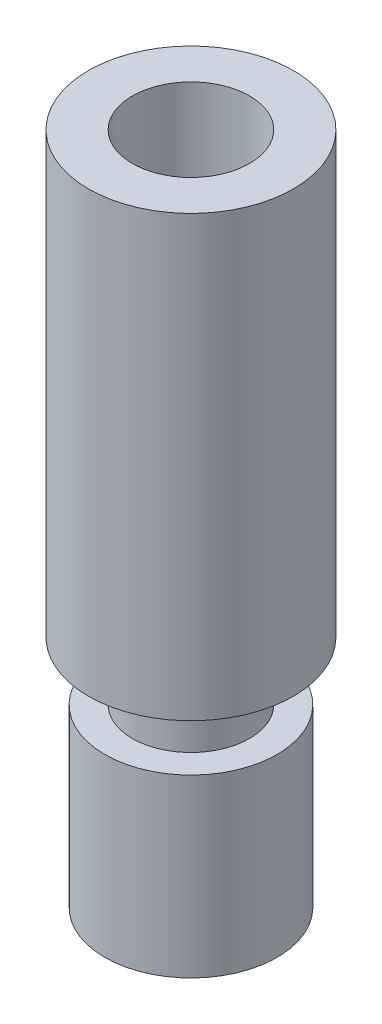
ISO-10303-21;
HEADER;
FILE_DESCRIPTION(('STEP AP214'),'2;1');
FILE_NAME('part.step','',(''),(''),'','','');
FILE_SCHEMA(('AUTOMOTIVE_DESIGN { 1 0 10303 214 1 1 1 1 }'));
ENDSEC;
DATA;
#1=APPLICATION_CONTEXT('core data for automotive mechanical design processes');
#2=APPLICATION_PROTOCOL_DEFINITION('international standard','automotive_design',2000,#1);
#3=PRODUCT_CONTEXT('',#1,'mechanical');
#4=PRODUCT('Part','Part','',(#3));
#5=PRODUCT_RELATED_PRODUCT_CATEGORY('part','',(#4));
#6=PRODUCT_DEFINITION_FORMATION('','',#4);
#7=PRODUCT_DEFINITION_CONTEXT('part definition',#1,'design');
#8=PRODUCT_DEFINITION('design','',#6,#7);
#9=PRODUCT_DEFINITION_SHAPE('','',#8);
#10=(LENGTH_UNIT() NAMED_UNIT(*) SI_UNIT(.MILLI.,.METRE.));
#11=(NAMED_UNIT(*) PLANE_ANGLE_UNIT() SI_UNIT($,.RADIAN.));
#12=(NAMED_UNIT(*) SI_UNIT($,.STERADIAN.) SOLID_ANGLE_UNIT());
#13=UNCERTAINTY_MEASURE_WITH_UNIT(LENGTH_MEASURE(1.E-05),#10,'distance_accuracy_value','');
#14=(GEOMETRIC_REPRESENTATION_CONTEXT(3) GLOBAL_UNCERTAINTY_ASSIGNED_CONTEXT((#13)) GLOBAL_UNIT_ASSIGNED_CONTEXT((#10,
#11,#12)) REPRESENTATION_CONTEXT('',''));
#15=CARTESIAN_POINT('',(0.,0.,0.));
#16=DIRECTION('',(0.,0.,1.));
#17=DIRECTION('',(1.,0.,0.));
#18=AXIS2_PLACEMENT_3D('',#15,#16,#17);
#19=CARTESIAN_POINT('',(15.500000230968,14.,7.00000010430813));
#20=DIRECTION('',(0.,1.,0.));
#21=DIRECTION('',(0.,0.,1.));
#22=AXIS2_PLACEMENT_3D('',#19,#20,#21);
#23=PLANE('',#22);
#24=CARTESIAN_POINT('',(15.500000230968,14.,7.00000010430813));
#25=DIRECTION('',(0.,-1.,0.));
#26=DIRECTION('',(0.,0.,-1.));
#27=AXIS2_PLACEMENT_3D('',#24,#25,#26);
#28=CIRCLE('',#27,1.5);
#29=CARTESIAN_POINT('',(15.500000230968,14.,5.50000010430813));
#30=VERTEX_POINT('',#29);
#31=EDGE_CURVE('E17',#30,#30,#28,.F.);
#32=ORIENTED_EDGE('',*,*,#31,.T.);
#33=EDGE_LOOP('',(#32));
#34=FACE_BOUND('',#33,.T.);
#35=CARTESIAN_POINT('',(15.500000230968,14.,7.00000010430813));
#36=DIRECTION('',(0.,-1.,0.));
#37=DIRECTION('',(0.,0.,-1.));
#38=AXIS2_PLACEMENT_3D('',#35,#36,#37);
#39=CIRCLE('',#38,2.942);
#40=CARTESIAN_POINT('',(15.500000230968,14.,4.05800010430813));
#41=VERTEX_POINT('',#40);
#42=EDGE_CURVE('E44',#41,#41,#39,.F.);
#43=ORIENTED_EDGE('',*,*,#42,.F.);
#44=EDGE_LOOP('',(#43));
#45=FACE_BOUND('',#44,.T.);
#46=ADVANCED_FACE('F14',(#34,#45),#23,.F.);
#47=CARTESIAN_POINT('',(15.500000230968,22.75,7.00000010430813));
#48=DIRECTION('',(0.,-1.,0.));
#49=DIRECTION('',(0.,0.,-1.));
#50=AXIS2_PLACEMENT_3D('',#47,#48,#49);
#51=CYLINDRICAL_SURFACE('',#50,1.5);
#52=ORIENTED_EDGE('',*,*,#31,.F.);
#53=EDGE_LOOP('',(#52));
#54=FACE_BOUND('',#53,.T.);
#55=CARTESIAN_POINT('',(15.500000230968,31.4999999999941,7.00000010430813));
#56=DIRECTION('',(0.,1.,0.));
#57=DIRECTION('',(0.999999999999998,0.,-6.56625413746781E-08));
#58=AXIS2_PLACEMENT_3D('',#55,#56,#57);
#59=CIRCLE('',#58,1.50000000003957);
#60=CARTESIAN_POINT('',(17.0000002310076,31.4999999999941,7.00000000581432));
#61=VERTEX_POINT('',#60);
#62=EDGE_CURVE('E43',#61,#61,#59,.T.);
#63=ORIENTED_EDGE('',*,*,#62,.T.);
#64=EDGE_LOOP('',(#63));
#65=FACE_BOUND('',#64,.T.);
#66=ADVANCED_FACE('F54',(#54,#65),#51,.F.);
#67=CARTESIAN_POINT('',(15.500000230968,20.,7.00000010430813));
#68=DIRECTION('',(0.,-1.,0.));
#69=DIRECTION('',(0.,0.,-1.));
#70=AXIS2_PLACEMENT_3D('',#67,#68,#69);
#71=CYLINDRICAL_SURFACE('',#70,2.942);
#72=CARTESIAN_POINT('',(15.500000230968,20.,7.00000010430813));
#73=DIRECTION('',(0.,-1.,0.));
#74=DIRECTION('',(0.,0.,-1.));
#75=AXIS2_PLACEMENT_3D('',#72,#73,#74);
#76=CIRCLE('',#75,2.942);
#77=CARTESIAN_POINT('',(15.500000230968,20.,4.05800010430813));
#78=VERTEX_POINT('',#77);
#79=EDGE_CURVE('E41',#78,#78,#76,.F.);
#80=ORIENTED_EDGE('',*,*,#79,.F.);
#81=EDGE_LOOP('',(#80));
#82=FACE_BOUND('',#81,.T.);
#83=ORIENTED_EDGE('',*,*,#42,.T.);
#84=EDGE_LOOP('',(#83));
#85=FACE_BOUND('',#84,.T.);
#86=ADVANCED_FACE('F57',(#82,#85),#71,.T.);
#87=CARTESIAN_POINT('',(15.500000230968,31.9999999999254,7.00000010430813));
#88=DIRECTION('',(0.,1.,0.));
#89=DIRECTION('',(0.,0.,1.));
#90=AXIS2_PLACEMENT_3D('',#87,#88,#89);
#91=CONICAL_SURFACE('',#90,1.9999999999709,0.785398163454293);
#92=ORIENTED_EDGE('',*,*,#62,.F.);
#93=EDGE_LOOP('',(#92));
#94=FACE_BOUND('',#93,.T.);
#95=CARTESIAN_POINT('',(15.500000230968,32.,7.00000010430813));
#96=DIRECTION('',(0.,-1.,0.));
#97=DIRECTION('',(0.,0.,-1.));
#98=AXIS2_PLACEMENT_3D('',#95,#96,#97);
#99=CIRCLE('',#98,2.);
#100=CARTESIAN_POINT('',(15.500000230968,32.,5.00000010430813));
#101=VERTEX_POINT('',#100);
#102=EDGE_CURVE('E40',#101,#101,#99,.F.);
#103=ORIENTED_EDGE('',*,*,#102,.T.);
#104=EDGE_LOOP('',(#103));
#105=FACE_BOUND('',#104,.T.);
#106=ADVANCED_FACE('F60',(#94,#105),#91,.F.);
#107=CARTESIAN_POINT('',(15.500000230968,20.,7.00000010430813));
#108=DIRECTION('',(0.,1.,0.));
#109=DIRECTION('',(0.,0.,1.));
#110=AXIS2_PLACEMENT_3D('',#107,#108,#109);
#111=PLANE('',#110);
#112=CARTESIAN_POINT('',(15.500000230968,20.,7.00000010430813));
#113=DIRECTION('',(0.,1.,0.));
#114=DIRECTION('',(0.,0.,1.));
#115=AXIS2_PLACEMENT_3D('',#112,#113,#114);
#116=CIRCLE('',#115,2.);
#117=CARTESIAN_POINT('',(15.500000230968,20.,9.00000010430813));
#118=VERTEX_POINT('',#117);
#119=EDGE_CURVE('E37',#118,#118,#116,.T.);
#120=ORIENTED_EDGE('',*,*,#119,.F.);
#121=EDGE_LOOP('',(#120));
#122=FACE_BOUND('',#121,.T.);
#123=ORIENTED_EDGE('',*,*,#79,.T.);
#124=EDGE_LOOP('',(#123));
#125=FACE_BOUND('',#124,.T.);
#126=ADVANCED_FACE('F63',(#122,#125),#111,.T.);
#127=CARTESIAN_POINT('',(15.500000230968,34.5,7.00000010430813));
#128=DIRECTION('',(0.,-1.,0.));
#129=DIRECTION('',(0.,0.,-1.));
#130=AXIS2_PLACEMENT_3D('',#127,#128,#129);
#131=CYLINDRICAL_SURFACE('',#130,2.);
#132=ORIENTED_EDGE('',*,*,#102,.F.);
#133=EDGE_LOOP('',(#132));
#134=FACE_BOUND('',#133,.T.);
#135=CARTESIAN_POINT('',(15.500000230968,37.,7.00000010430813));
#136=DIRECTION('',(0.,-1.,0.));
#137=DIRECTION('',(0.,0.,-1.));
#138=AXIS2_PLACEMENT_3D('',#135,#136,#137);
#139=CIRCLE('',#138,2.);
#140=CARTESIAN_POINT('',(15.500000230968,37.,5.00000010430813));
#141=VERTEX_POINT('',#140);
#142=EDGE_CURVE('E34',#141,#141,#139,.T.);
#143=ORIENTED_EDGE('',*,*,#142,.F.);
#144=EDGE_LOOP('',(#143));
#145=FACE_BOUND('',#144,.T.);
#146=ADVANCED_FACE('F71',(#134,#145),#131,.F.);
#147=CARTESIAN_POINT('',(15.500000230968,20.,7.00000010430813));
#148=DIRECTION('',(0.,1.,0.));
#149=DIRECTION('',(0.,0.,1.));
#150=AXIS2_PLACEMENT_3D('',#147,#148,#149);
#151=CYLINDRICAL_SURFACE('',#150,2.);
#152=ORIENTED_EDGE('',*,*,#119,.T.);
#153=EDGE_LOOP('',(#152));
#154=FACE_BOUND('',#153,.T.);
#155=CARTESIAN_POINT('',(15.500000230968,22.,7.00000010430813));
#156=DIRECTION('',(0.,1.,0.));
#157=DIRECTION('',(0.,0.,1.));
#158=AXIS2_PLACEMENT_3D('',#155,#156,#157);
#159=CIRCLE('',#158,2.);
#160=CARTESIAN_POINT('',(15.500000230968,22.,9.00000010430813));
#161=VERTEX_POINT('',#160);
#162=EDGE_CURVE('E26',#161,#161,#159,.F.);
#163=ORIENTED_EDGE('',*,*,#162,.T.);
#164=EDGE_LOOP('',(#163));
#165=FACE_BOUND('',#164,.T.);
#166=ADVANCED_FACE('F74',(#154,#165),#151,.T.);
#167=CARTESIAN_POINT('',(15.500000230968,37.,7.00000010430813));
#168=DIRECTION('',(0.,1.,0.));
#169=DIRECTION('',(0.,0.,1.));
#170=AXIS2_PLACEMENT_3D('',#167,#168,#169);
#171=PLANE('',#170);
#172=ORIENTED_EDGE('',*,*,#142,.T.);
#173=EDGE_LOOP('',(#172));
#174=FACE_BOUND('',#173,.T.);
#175=CARTESIAN_POINT('',(15.500000230968,37.,7.00000010430813));
#176=DIRECTION('',(0.,1.,0.));
#177=DIRECTION('',(0.,0.,1.));
#178=AXIS2_PLACEMENT_3D('',#175,#176,#177);
#179=CIRCLE('',#178,3.5);
#180=CARTESIAN_POINT('',(15.500000230968,37.,10.5000001043081));
#181=VERTEX_POINT('',#180);
#182=EDGE_CURVE('E21',#181,#181,#179,.F.);
#183=ORIENTED_EDGE('',*,*,#182,.F.);
#184=EDGE_LOOP('',(#183));
#185=FACE_BOUND('',#184,.T.);
#186=ADVANCED_FACE('F78',(#174,#185),#171,.T.);
#187=CARTESIAN_POINT('',(15.500000230968,22.,7.00000010430813));
#188=DIRECTION('',(0.,1.,0.));
#189=DIRECTION('',(0.,0.,1.));
#190=AXIS2_PLACEMENT_3D('',#187,#188,#189);
#191=PLANE('',#190);
#192=ORIENTED_EDGE('',*,*,#162,.F.);
#193=EDGE_LOOP('',(#192));
#194=FACE_BOUND('',#193,.T.);
#195=CARTESIAN_POINT('',(15.500000230968,22.,7.00000010430813));
#196=DIRECTION('',(0.,1.,0.));
#197=DIRECTION('',(0.,0.,1.));
#198=AXIS2_PLACEMENT_3D('',#195,#196,#197);
#199=CIRCLE('',#198,3.5);
#200=CARTESIAN_POINT('',(15.500000230968,22.,10.5000001043081));
#201=VERTEX_POINT('',#200);
#202=EDGE_CURVE('E9',#201,#201,#199,.T.);
#203=ORIENTED_EDGE('',*,*,#202,.F.);
#204=EDGE_LOOP('',(#203));
#205=FACE_BOUND('',#204,.T.);
#206=ADVANCED_FACE('F81',(#194,#205),#191,.F.);
#207=CARTESIAN_POINT('',(15.500000230968,22.,7.00000010430813));
#208=DIRECTION('',(0.,1.,0.));
#209=DIRECTION('',(0.,0.,1.));
#210=AXIS2_PLACEMENT_3D('',#207,#208,#209);
#211=CYLINDRICAL_SURFACE('',#210,3.5);
#212=ORIENTED_EDGE('',*,*,#202,.T.);
#213=EDGE_LOOP('',(#212));
#214=FACE_BOUND('',#213,.T.);
#215=ORIENTED_EDGE('',*,*,#182,.T.);
#216=EDGE_LOOP('',(#215));
#217=FACE_BOUND('',#216,.T.);
#218=ADVANCED_FACE('F85',(#214,#217),#211,.T.);
#219=CLOSED_SHELL('',(#46,#66,#86,#106,#126,#146,#166,#186,#206,#218));
#220=MANIFOLD_SOLID_BREP('B1',#219);
#221=ADVANCED_BREP_SHAPE_REPRESENTATION('',(#18,#220),#14);
#222=SHAPE_DEFINITION_REPRESENTATION(#9,#221);
ENDSEC;
END-ISO-10303-21;
